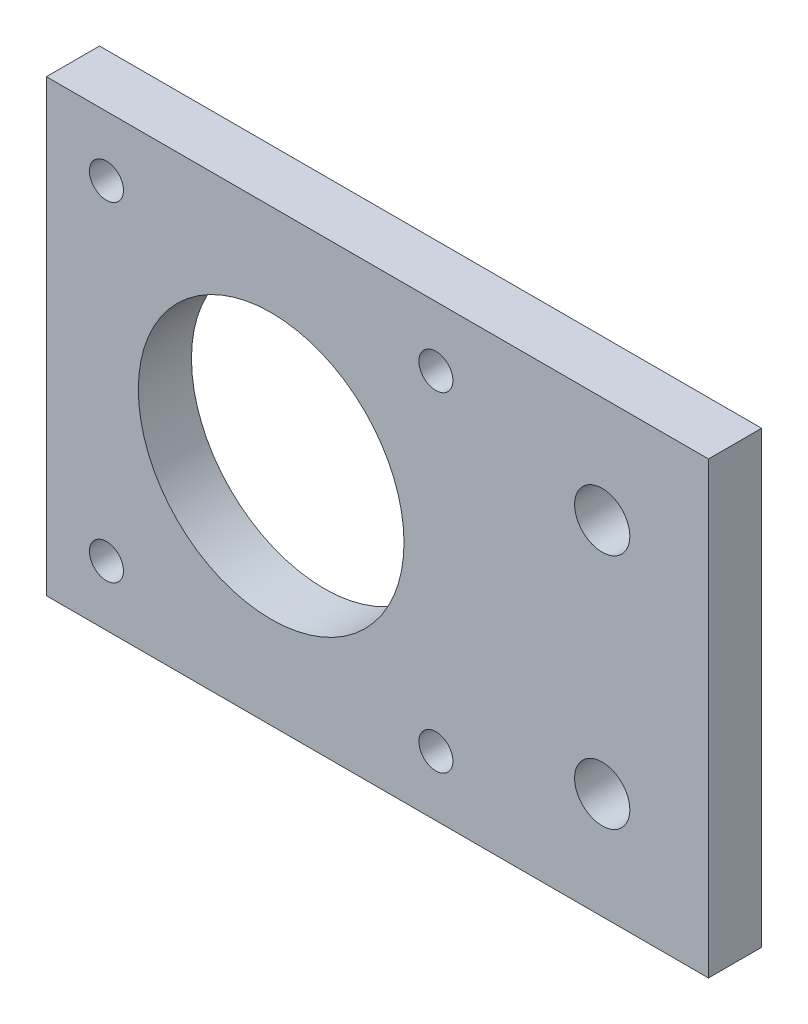
ISO-10303-21;
HEADER;
FILE_DESCRIPTION(('STEP AP214'),'2;1');
FILE_NAME('part.step','',(''),(''),'','','');
FILE_SCHEMA(('AUTOMOTIVE_DESIGN { 1 0 10303 214 1 1 1 1 }'));
ENDSEC;
DATA;
#1=APPLICATION_CONTEXT('core data for automotive mechanical design processes');
#2=APPLICATION_PROTOCOL_DEFINITION('international standard','automotive_design',2000,#1);
#3=PRODUCT_CONTEXT('',#1,'mechanical');
#4=PRODUCT('Part','Part','',(#3));
#5=PRODUCT_RELATED_PRODUCT_CATEGORY('part','',(#4));
#6=PRODUCT_DEFINITION_FORMATION('','',#4);
#7=PRODUCT_DEFINITION_CONTEXT('part definition',#1,'design');
#8=PRODUCT_DEFINITION('design','',#6,#7);
#9=PRODUCT_DEFINITION_SHAPE('','',#8);
#10=(LENGTH_UNIT() NAMED_UNIT(*) SI_UNIT(.MILLI.,.METRE.));
#11=(NAMED_UNIT(*) PLANE_ANGLE_UNIT() SI_UNIT($,.RADIAN.));
#12=(NAMED_UNIT(*) SI_UNIT($,.STERADIAN.) SOLID_ANGLE_UNIT());
#13=UNCERTAINTY_MEASURE_WITH_UNIT(LENGTH_MEASURE(1.E-05),#10,'distance_accuracy_value','');
#14=(GEOMETRIC_REPRESENTATION_CONTEXT(3) GLOBAL_UNCERTAINTY_ASSIGNED_CONTEXT((#13)) GLOBAL_UNIT_ASSIGNED_CONTEXT((#10,
#11,#12)) REPRESENTATION_CONTEXT('',''));
#15=CARTESIAN_POINT('',(0.,0.,0.));
#16=DIRECTION('',(0.,0.,1.));
#17=DIRECTION('',(1.,0.,0.));
#18=AXIS2_PLACEMENT_3D('',#15,#16,#17);
#19=CARTESIAN_POINT('',(0.,-21.15,5.));
#20=DIRECTION('',(0.,1.,0.));
#21=DIRECTION('',(0.,0.,1.));
#22=AXIS2_PLACEMENT_3D('',#19,#20,#21);
#23=PLANE('',#22);
#24=DIRECTION('',(1.,0.,0.));
#25=VECTOR('',#24,1.);
#26=CARTESIAN_POINT('',(0.,-21.15,0.));
#27=LINE('',#26,#25);
#28=CARTESIAN_POINT('',(-21.15,-21.15,0.));
#29=VERTEX_POINT('',#28);
#30=CARTESIAN_POINT('',(41.15,-21.15,0.));
#31=VERTEX_POINT('',#30);
#32=EDGE_CURVE('E115',#29,#31,#27,.T.);
#33=ORIENTED_EDGE('',*,*,#32,.T.);
#34=DIRECTION('',(0.,0.,-1.));
#35=VECTOR('',#34,1.);
#36=CARTESIAN_POINT('',(41.15,-21.15,5.));
#37=LINE('',#36,#35);
#38=CARTESIAN_POINT('',(41.15,-21.15,5.));
#39=VERTEX_POINT('',#38);
#40=EDGE_CURVE('E11',#39,#31,#37,.T.);
#41=ORIENTED_EDGE('',*,*,#40,.F.);
#42=DIRECTION('',(1.,0.,0.));
#43=VECTOR('',#42,1.);
#44=CARTESIAN_POINT('',(0.,-21.15,5.));
#45=LINE('',#44,#43);
#46=CARTESIAN_POINT('',(-21.15,-21.15,5.));
#47=VERTEX_POINT('',#46);
#48=EDGE_CURVE('E72',#47,#39,#45,.T.);
#49=ORIENTED_EDGE('',*,*,#48,.F.);
#50=DIRECTION('',(0.,0.,-1.));
#51=VECTOR('',#50,1.);
#52=CARTESIAN_POINT('',(-21.15,-21.15,5.));
#53=LINE('',#52,#51);
#54=EDGE_CURVE('E101',#47,#29,#53,.T.);
#55=ORIENTED_EDGE('',*,*,#54,.T.);
#56=EDGE_LOOP('',(#33,#41,#49,#55));
#57=FACE_BOUND('',#56,.T.);
#58=ADVANCED_FACE('F32',(#57),#23,.F.);
#59=CARTESIAN_POINT('',(41.15,0.,5.));
#60=DIRECTION('',(1.,0.,0.));
#61=DIRECTION('',(0.,0.,-1.));
#62=AXIS2_PLACEMENT_3D('',#59,#60,#61);
#63=PLANE('',#62);
#64=DIRECTION('',(0.,-1.,0.));
#65=VECTOR('',#64,1.);
#66=CARTESIAN_POINT('',(41.15,0.,0.));
#67=LINE('',#66,#65);
#68=CARTESIAN_POINT('',(41.15,21.15,0.));
#69=VERTEX_POINT('',#68);
#70=EDGE_CURVE('E81',#69,#31,#67,.T.);
#71=ORIENTED_EDGE('',*,*,#70,.F.);
#72=DIRECTION('',(0.,0.,-1.));
#73=VECTOR('',#72,1.);
#74=CARTESIAN_POINT('',(41.15,21.15,5.));
#75=LINE('',#74,#73);
#76=CARTESIAN_POINT('',(41.15,21.15,5.));
#77=VERTEX_POINT('',#76);
#78=EDGE_CURVE('E41',#77,#69,#75,.T.);
#79=ORIENTED_EDGE('',*,*,#78,.F.);
#80=DIRECTION('',(0.,-1.,0.));
#81=VECTOR('',#80,1.);
#82=CARTESIAN_POINT('',(41.15,0.,5.));
#83=LINE('',#82,#81);
#84=EDGE_CURVE('E79',#77,#39,#83,.T.);
#85=ORIENTED_EDGE('',*,*,#84,.T.);
#86=ORIENTED_EDGE('',*,*,#40,.T.);
#87=EDGE_LOOP('',(#71,#79,#85,#86));
#88=FACE_BOUND('',#87,.T.);
#89=ADVANCED_FACE('F78',(#88),#63,.T.);
#90=CARTESIAN_POINT('',(0.,21.15,5.));
#91=DIRECTION('',(0.,1.,0.));
#92=DIRECTION('',(0.,0.,1.));
#93=AXIS2_PLACEMENT_3D('',#90,#91,#92);
#94=PLANE('',#93);
#95=DIRECTION('',(1.,0.,0.));
#96=VECTOR('',#95,1.);
#97=CARTESIAN_POINT('',(0.,21.15,0.));
#98=LINE('',#97,#96);
#99=CARTESIAN_POINT('',(-21.15,21.15,0.));
#100=VERTEX_POINT('',#99);
#101=EDGE_CURVE('E119',#100,#69,#98,.T.);
#102=ORIENTED_EDGE('',*,*,#101,.F.);
#103=DIRECTION('',(0.,0.,-1.));
#104=VECTOR('',#103,1.);
#105=CARTESIAN_POINT('',(-21.15,21.15,5.));
#106=LINE('',#105,#104);
#107=CARTESIAN_POINT('',(-21.15,21.15,5.));
#108=VERTEX_POINT('',#107);
#109=EDGE_CURVE('E64',#108,#100,#106,.T.);
#110=ORIENTED_EDGE('',*,*,#109,.F.);
#111=DIRECTION('',(1.,0.,0.));
#112=VECTOR('',#111,1.);
#113=CARTESIAN_POINT('',(0.,21.15,5.));
#114=LINE('',#113,#112);
#115=EDGE_CURVE('E88',#108,#77,#114,.T.);
#116=ORIENTED_EDGE('',*,*,#115,.T.);
#117=ORIENTED_EDGE('',*,*,#78,.T.);
#118=EDGE_LOOP('',(#102,#110,#116,#117));
#119=FACE_BOUND('',#118,.T.);
#120=ADVANCED_FACE('F90',(#119),#94,.T.);
#121=CARTESIAN_POINT('',(31.15,-11.15,5.));
#122=DIRECTION('',(0.,0.,-1.));
#123=DIRECTION('',(-1.,0.,0.));
#124=AXIS2_PLACEMENT_3D('',#121,#122,#123);
#125=CYLINDRICAL_SURFACE('',#124,2.6);
#126=CARTESIAN_POINT('',(31.15,-11.15,5.));
#127=DIRECTION('',(0.,0.,1.));
#128=DIRECTION('',(1.,0.,0.));
#129=AXIS2_PLACEMENT_3D('',#126,#127,#128);
#130=CIRCLE('',#129,2.6);
#131=CARTESIAN_POINT('',(33.75,-11.15,5.));
#132=VERTEX_POINT('',#131);
#133=EDGE_CURVE('E92',#132,#132,#130,.T.);
#134=ORIENTED_EDGE('',*,*,#133,.T.);
#135=EDGE_LOOP('',(#134));
#136=FACE_BOUND('',#135,.T.);
#137=CARTESIAN_POINT('',(31.15,-11.15,0.));
#138=DIRECTION('',(0.,0.,1.));
#139=DIRECTION('',(1.,0.,0.));
#140=AXIS2_PLACEMENT_3D('',#137,#138,#139);
#141=CIRCLE('',#140,2.6);
#142=CARTESIAN_POINT('',(33.75,-11.15,0.));
#143=VERTEX_POINT('',#142);
#144=EDGE_CURVE('E122',#143,#143,#141,.T.);
#145=ORIENTED_EDGE('',*,*,#144,.F.);
#146=EDGE_LOOP('',(#145));
#147=FACE_BOUND('',#146,.T.);
#148=ADVANCED_FACE('F265',(#136,#147),#125,.F.);
#149=CARTESIAN_POINT('',(-21.15,0.,5.));
#150=DIRECTION('',(1.,0.,0.));
#151=DIRECTION('',(0.,1.,0.));
#152=AXIS2_PLACEMENT_3D('',#149,#150,#151);
#153=PLANE('',#152);
#154=DIRECTION('',(0.,-1.,0.));
#155=VECTOR('',#154,1.);
#156=CARTESIAN_POINT('',(-21.15,0.,0.));
#157=LINE('',#156,#155);
#158=EDGE_CURVE('E67',#100,#29,#157,.T.);
#159=ORIENTED_EDGE('',*,*,#158,.T.);
#160=ORIENTED_EDGE('',*,*,#54,.F.);
#161=DIRECTION('',(0.,-1.,0.));
#162=VECTOR('',#161,1.);
#163=CARTESIAN_POINT('',(-21.15,0.,5.));
#164=LINE('',#163,#162);
#165=EDGE_CURVE('E49',#108,#47,#164,.T.);
#166=ORIENTED_EDGE('',*,*,#165,.F.);
#167=ORIENTED_EDGE('',*,*,#109,.T.);
#168=EDGE_LOOP('',(#159,#160,#166,#167));
#169=FACE_BOUND('',#168,.T.);
#170=ADVANCED_FACE('F168',(#169),#153,.F.);
#171=CARTESIAN_POINT('',(-15.5,15.5,5.));
#172=DIRECTION('',(0.,0.,-1.));
#173=DIRECTION('',(-1.,0.,0.));
#174=AXIS2_PLACEMENT_3D('',#171,#172,#173);
#175=CYLINDRICAL_SURFACE('',#174,1.6);
#176=CARTESIAN_POINT('',(-15.5,15.5,5.));
#177=DIRECTION('',(0.,0.,1.));
#178=DIRECTION('',(1.,0.,0.));
#179=AXIS2_PLACEMENT_3D('',#176,#177,#178);
#180=CIRCLE('',#179,1.6);
#181=CARTESIAN_POINT('',(-13.9,15.5,5.));
#182=VERTEX_POINT('',#181);
#183=EDGE_CURVE('E192',#182,#182,#180,.T.);
#184=ORIENTED_EDGE('',*,*,#183,.T.);
#185=EDGE_LOOP('',(#184));
#186=FACE_BOUND('',#185,.T.);
#187=CARTESIAN_POINT('',(-15.5,15.5,0.));
#188=DIRECTION('',(0.,0.,1.));
#189=DIRECTION('',(1.,0.,0.));
#190=AXIS2_PLACEMENT_3D('',#187,#188,#189);
#191=CIRCLE('',#190,1.6);
#192=CARTESIAN_POINT('',(-13.9,15.5,0.));
#193=VERTEX_POINT('',#192);
#194=EDGE_CURVE('E112',#193,#193,#191,.T.);
#195=ORIENTED_EDGE('',*,*,#194,.F.);
#196=EDGE_LOOP('',(#195));
#197=FACE_BOUND('',#196,.T.);
#198=ADVANCED_FACE('F164',(#186,#197),#175,.F.);
#199=CARTESIAN_POINT('',(15.5,-15.5,5.));
#200=DIRECTION('',(0.,0.,-1.));
#201=DIRECTION('',(-1.,0.,0.));
#202=AXIS2_PLACEMENT_3D('',#199,#200,#201);
#203=CYLINDRICAL_SURFACE('',#202,1.6);
#204=CARTESIAN_POINT('',(15.5,-15.5,5.));
#205=DIRECTION('',(0.,0.,1.));
#206=DIRECTION('',(1.,0.,0.));
#207=AXIS2_PLACEMENT_3D('',#204,#205,#206);
#208=CIRCLE('',#207,1.6);
#209=CARTESIAN_POINT('',(17.1,-15.5,5.));
#210=VERTEX_POINT('',#209);
#211=EDGE_CURVE('E189',#210,#210,#208,.T.);
#212=ORIENTED_EDGE('',*,*,#211,.T.);
#213=EDGE_LOOP('',(#212));
#214=FACE_BOUND('',#213,.T.);
#215=CARTESIAN_POINT('',(15.5,-15.5,0.));
#216=DIRECTION('',(0.,0.,1.));
#217=DIRECTION('',(1.,0.,0.));
#218=AXIS2_PLACEMENT_3D('',#215,#216,#217);
#219=CIRCLE('',#218,1.6);
#220=CARTESIAN_POINT('',(17.1,-15.5,0.));
#221=VERTEX_POINT('',#220);
#222=EDGE_CURVE('E109',#221,#221,#219,.T.);
#223=ORIENTED_EDGE('',*,*,#222,.F.);
#224=EDGE_LOOP('',(#223));
#225=FACE_BOUND('',#224,.T.);
#226=ADVANCED_FACE('F167',(#214,#225),#203,.F.);
#227=CARTESIAN_POINT('',(15.5,15.5,5.));
#228=DIRECTION('',(0.,0.,-1.));
#229=DIRECTION('',(-1.,0.,0.));
#230=AXIS2_PLACEMENT_3D('',#227,#228,#229);
#231=CYLINDRICAL_SURFACE('',#230,1.6);
#232=CARTESIAN_POINT('',(15.5,15.5,5.));
#233=DIRECTION('',(0.,0.,1.));
#234=DIRECTION('',(1.,0.,0.));
#235=AXIS2_PLACEMENT_3D('',#232,#233,#234);
#236=CIRCLE('',#235,1.6);
#237=CARTESIAN_POINT('',(17.1,15.5,5.));
#238=VERTEX_POINT('',#237);
#239=EDGE_CURVE('E179',#238,#238,#236,.T.);
#240=ORIENTED_EDGE('',*,*,#239,.T.);
#241=EDGE_LOOP('',(#240));
#242=FACE_BOUND('',#241,.T.);
#243=CARTESIAN_POINT('',(15.5,15.5,0.));
#244=DIRECTION('',(0.,0.,1.));
#245=DIRECTION('',(1.,0.,0.));
#246=AXIS2_PLACEMENT_3D('',#243,#244,#245);
#247=CIRCLE('',#246,1.6);
#248=CARTESIAN_POINT('',(17.1,15.5,0.));
#249=VERTEX_POINT('',#248);
#250=EDGE_CURVE('E105',#249,#249,#247,.T.);
#251=ORIENTED_EDGE('',*,*,#250,.F.);
#252=EDGE_LOOP('',(#251));
#253=FACE_BOUND('',#252,.T.);
#254=ADVANCED_FACE('F153',(#242,#253),#231,.F.);
#255=CARTESIAN_POINT('',(-15.5,-15.5,5.));
#256=DIRECTION('',(0.,0.,-1.));
#257=DIRECTION('',(-1.,0.,0.));
#258=AXIS2_PLACEMENT_3D('',#255,#256,#257);
#259=CYLINDRICAL_SURFACE('',#258,1.6);
#260=CARTESIAN_POINT('',(-15.5,-15.5,5.));
#261=DIRECTION('',(0.,0.,1.));
#262=DIRECTION('',(1.,0.,0.));
#263=AXIS2_PLACEMENT_3D('',#260,#261,#262);
#264=CIRCLE('',#263,1.6);
#265=CARTESIAN_POINT('',(-13.9,-15.5,5.));
#266=VERTEX_POINT('',#265);
#267=EDGE_CURVE('E128',#266,#266,#264,.T.);
#268=ORIENTED_EDGE('',*,*,#267,.T.);
#269=EDGE_LOOP('',(#268));
#270=FACE_BOUND('',#269,.T.);
#271=CARTESIAN_POINT('',(-15.5,-15.5,0.));
#272=DIRECTION('',(0.,0.,1.));
#273=DIRECTION('',(1.,0.,0.));
#274=AXIS2_PLACEMENT_3D('',#271,#272,#273);
#275=CIRCLE('',#274,1.6);
#276=CARTESIAN_POINT('',(-13.9,-15.5,0.));
#277=VERTEX_POINT('',#276);
#278=EDGE_CURVE('E102',#277,#277,#275,.T.);
#279=ORIENTED_EDGE('',*,*,#278,.F.);
#280=EDGE_LOOP('',(#279));
#281=FACE_BOUND('',#280,.T.);
#282=ADVANCED_FACE('F34',(#270,#281),#259,.F.);
#283=CARTESIAN_POINT('',(31.15,11.15,5.));
#284=DIRECTION('',(0.,0.,-1.));
#285=DIRECTION('',(-1.,0.,0.));
#286=AXIS2_PLACEMENT_3D('',#283,#284,#285);
#287=CYLINDRICAL_SURFACE('',#286,2.59999999999999);
#288=CARTESIAN_POINT('',(31.15,11.15,5.));
#289=DIRECTION('',(0.,0.,1.));
#290=DIRECTION('',(1.,0.,0.));
#291=AXIS2_PLACEMENT_3D('',#288,#289,#290);
#292=CIRCLE('',#291,2.59999999999999);
#293=CARTESIAN_POINT('',(33.75,11.15,5.));
#294=VERTEX_POINT('',#293);
#295=EDGE_CURVE('E98',#294,#294,#292,.T.);
#296=ORIENTED_EDGE('',*,*,#295,.T.);
#297=EDGE_LOOP('',(#296));
#298=FACE_BOUND('',#297,.T.);
#299=CARTESIAN_POINT('',(31.15,11.15,0.));
#300=DIRECTION('',(0.,0.,1.));
#301=DIRECTION('',(1.,0.,0.));
#302=AXIS2_PLACEMENT_3D('',#299,#300,#301);
#303=CIRCLE('',#302,2.59999999999999);
#304=CARTESIAN_POINT('',(33.75,11.15,0.));
#305=VERTEX_POINT('',#304);
#306=EDGE_CURVE('E125',#305,#305,#303,.T.);
#307=ORIENTED_EDGE('',*,*,#306,.F.);
#308=EDGE_LOOP('',(#307));
#309=FACE_BOUND('',#308,.T.);
#310=ADVANCED_FACE('F143',(#298,#309),#287,.F.);
#311=CARTESIAN_POINT('',(0.,0.,5.));
#312=DIRECTION('',(0.,0.,1.));
#313=DIRECTION('',(1.,0.,0.));
#314=AXIS2_PLACEMENT_3D('',#311,#312,#313);
#315=PLANE('',#314);
#316=CARTESIAN_POINT('',(0.,0.,5.));
#317=DIRECTION('',(0.,0.,1.));
#318=DIRECTION('',(1.,0.,0.));
#319=AXIS2_PLACEMENT_3D('',#316,#317,#318);
#320=CIRCLE('',#319,12.5);
#321=CARTESIAN_POINT('',(12.5,0.,5.));
#322=VERTEX_POINT('',#321);
#323=EDGE_CURVE('E106',#322,#322,#320,.T.);
#324=ORIENTED_EDGE('',*,*,#323,.F.);
#325=EDGE_LOOP('',(#324));
#326=FACE_BOUND('',#325,.T.);
#327=ORIENTED_EDGE('',*,*,#267,.F.);
#328=EDGE_LOOP('',(#327));
#329=FACE_BOUND('',#328,.T.);
#330=ORIENTED_EDGE('',*,*,#239,.F.);
#331=EDGE_LOOP('',(#330));
#332=FACE_BOUND('',#331,.T.);
#333=ORIENTED_EDGE('',*,*,#211,.F.);
#334=EDGE_LOOP('',(#333));
#335=FACE_BOUND('',#334,.T.);
#336=ORIENTED_EDGE('',*,*,#183,.F.);
#337=EDGE_LOOP('',(#336));
#338=FACE_BOUND('',#337,.T.);
#339=ORIENTED_EDGE('',*,*,#48,.T.);
#340=ORIENTED_EDGE('',*,*,#84,.F.);
#341=ORIENTED_EDGE('',*,*,#115,.F.);
#342=ORIENTED_EDGE('',*,*,#165,.T.);
#343=EDGE_LOOP('',(#339,#340,#341,#342));
#344=FACE_BOUND('',#343,.T.);
#345=ORIENTED_EDGE('',*,*,#133,.F.);
#346=EDGE_LOOP('',(#345));
#347=FACE_BOUND('',#346,.T.);
#348=ORIENTED_EDGE('',*,*,#295,.F.);
#349=EDGE_LOOP('',(#348));
#350=FACE_BOUND('',#349,.T.);
#351=ADVANCED_FACE('F86',(#326,#329,#332,#335,#338,#344,#347,#350),#315,.T.);
#352=CARTESIAN_POINT('',(0.,0.,0.));
#353=DIRECTION('',(0.,0.,1.));
#354=DIRECTION('',(1.,0.,0.));
#355=AXIS2_PLACEMENT_3D('',#352,#353,#354);
#356=PLANE('',#355);
#357=CARTESIAN_POINT('',(0.,0.,0.));
#358=DIRECTION('',(0.,0.,-1.));
#359=DIRECTION('',(-1.,0.,0.));
#360=AXIS2_PLACEMENT_3D('',#357,#358,#359);
#361=CIRCLE('',#360,12.5);
#362=CARTESIAN_POINT('',(-12.5,0.,0.));
#363=VERTEX_POINT('',#362);
#364=EDGE_CURVE('E203',#363,#363,#361,.T.);
#365=ORIENTED_EDGE('',*,*,#364,.F.);
#366=EDGE_LOOP('',(#365));
#367=FACE_BOUND('',#366,.T.);
#368=ORIENTED_EDGE('',*,*,#278,.T.);
#369=EDGE_LOOP('',(#368));
#370=FACE_BOUND('',#369,.T.);
#371=ORIENTED_EDGE('',*,*,#250,.T.);
#372=EDGE_LOOP('',(#371));
#373=FACE_BOUND('',#372,.T.);
#374=ORIENTED_EDGE('',*,*,#222,.T.);
#375=EDGE_LOOP('',(#374));
#376=FACE_BOUND('',#375,.T.);
#377=ORIENTED_EDGE('',*,*,#194,.T.);
#378=EDGE_LOOP('',(#377));
#379=FACE_BOUND('',#378,.T.);
#380=ORIENTED_EDGE('',*,*,#32,.F.);
#381=ORIENTED_EDGE('',*,*,#158,.F.);
#382=ORIENTED_EDGE('',*,*,#101,.T.);
#383=ORIENTED_EDGE('',*,*,#70,.T.);
#384=EDGE_LOOP('',(#380,#381,#382,#383));
#385=FACE_BOUND('',#384,.T.);
#386=ORIENTED_EDGE('',*,*,#144,.T.);
#387=EDGE_LOOP('',(#386));
#388=FACE_BOUND('',#387,.T.);
#389=ORIENTED_EDGE('',*,*,#306,.T.);
#390=EDGE_LOOP('',(#389));
#391=FACE_BOUND('',#390,.T.);
#392=ADVANCED_FACE('F133',(#367,#370,#373,#376,#379,#385,#388,#391),#356,.F.);
#393=CARTESIAN_POINT('',(0.,0.,10.));
#394=DIRECTION('',(0.,0.,-1.));
#395=DIRECTION('',(-1.,0.,0.));
#396=AXIS2_PLACEMENT_3D('',#393,#394,#395);
#397=CYLINDRICAL_SURFACE('',#396,12.5);
#398=ORIENTED_EDGE('',*,*,#323,.T.);
#399=EDGE_LOOP('',(#398));
#400=FACE_BOUND('',#399,.T.);
#401=ORIENTED_EDGE('',*,*,#364,.T.);
#402=EDGE_LOOP('',(#401));
#403=FACE_BOUND('',#402,.T.);
#404=ADVANCED_FACE('F136',(#400,#403),#397,.F.);
#405=CLOSED_SHELL('',(#58,#89,#120,#148,#170,#198,#226,#254,#282,#310,#351,#392,#404));
#406=MANIFOLD_SOLID_BREP('B2',#405);
#407=ADVANCED_BREP_SHAPE_REPRESENTATION('',(#18,#406),#14);
#408=SHAPE_DEFINITION_REPRESENTATION(#9,#407);
ENDSEC;
END-ISO-10303-21;
